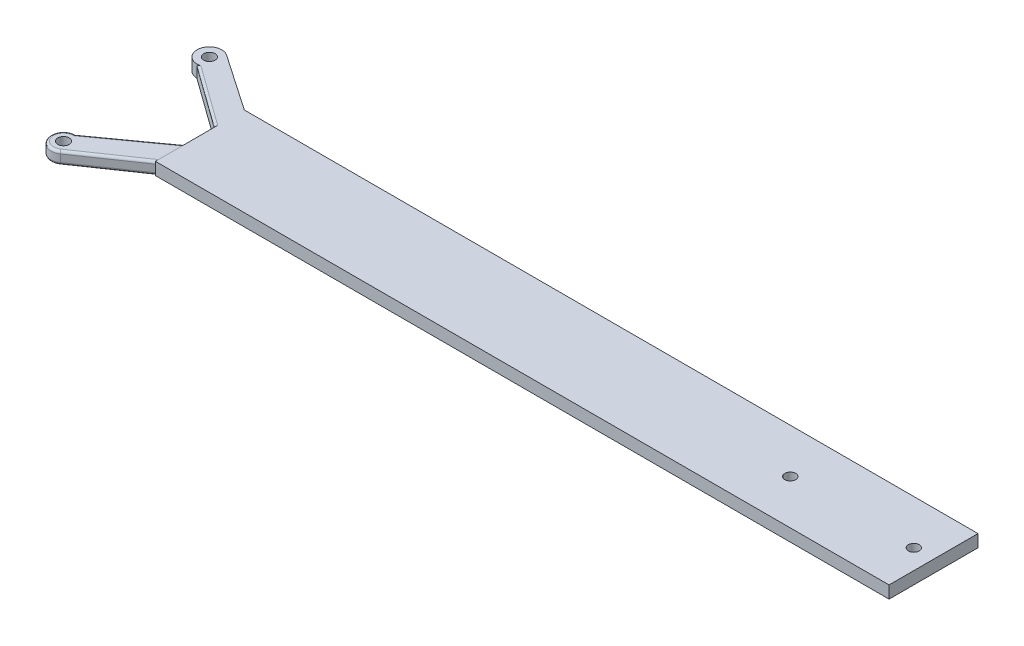
ISO-10303-21;
HEADER;
FILE_DESCRIPTION(('STEP AP214'),'2;1');
FILE_NAME('part.step','',(''),(''),'','','');
FILE_SCHEMA(('AUTOMOTIVE_DESIGN { 1 0 10303 214 1 1 1 1 }'));
ENDSEC;
DATA;
#1=APPLICATION_CONTEXT('core data for automotive mechanical design processes');
#2=APPLICATION_PROTOCOL_DEFINITION('international standard','automotive_design',2000,#1);
#3=PRODUCT_CONTEXT('',#1,'mechanical');
#4=PRODUCT('Part','Part','',(#3));
#5=PRODUCT_RELATED_PRODUCT_CATEGORY('part','',(#4));
#6=PRODUCT_DEFINITION_FORMATION('','',#4);
#7=PRODUCT_DEFINITION_CONTEXT('part definition',#1,'design');
#8=PRODUCT_DEFINITION('design','',#6,#7);
#9=PRODUCT_DEFINITION_SHAPE('','',#8);
#10=(LENGTH_UNIT() NAMED_UNIT(*) SI_UNIT(.MILLI.,.METRE.));
#11=(NAMED_UNIT(*) PLANE_ANGLE_UNIT() SI_UNIT($,.RADIAN.));
#12=(NAMED_UNIT(*) SI_UNIT($,.STERADIAN.) SOLID_ANGLE_UNIT());
#13=UNCERTAINTY_MEASURE_WITH_UNIT(LENGTH_MEASURE(1.E-05),#10,'distance_accuracy_value','');
#14=(GEOMETRIC_REPRESENTATION_CONTEXT(3) GLOBAL_UNCERTAINTY_ASSIGNED_CONTEXT((#13)) GLOBAL_UNIT_ASSIGNED_CONTEXT((#10,
#11,#12)) REPRESENTATION_CONTEXT('',''));
#15=CARTESIAN_POINT('',(0.,0.,0.));
#16=DIRECTION('',(0.,0.,1.));
#17=DIRECTION('',(1.,0.,0.));
#18=AXIS2_PLACEMENT_3D('',#15,#16,#17);
#19=CARTESIAN_POINT('',(-73.9332584912231,-0.60108083999999,102.697933506794));
#20=DIRECTION('',(0.58425656444107,0.,-0.811569015492532));
#21=DIRECTION('',(-0.811569015492532,0.,-0.58425656444107));
#22=AXIS2_PLACEMENT_3D('',#19,#20,#21);
#23=PLANE('',#22);
#24=DIRECTION('',(0.,-1.,0.));
#25=VECTOR('',#24,1.);
#26=CARTESIAN_POINT('',(-159.44986344,-0.601080839999992,41.1336834476488));
#27=LINE('',#26,#25);
#28=CARTESIAN_POINT('',(-159.44986344,-1.10108083999999,41.1336834476488));
#29=VERTEX_POINT('',#28);
#30=CARTESIAN_POINT('',(-159.44986344,-3.10108083999999,41.1336834476488));
#31=VERTEX_POINT('',#30);
#32=EDGE_CURVE('E233',#29,#31,#27,.T.);
#33=ORIENTED_EDGE('',*,*,#32,.F.);
#34=DIRECTION('',(0.811569015492532,0.,0.58425656444107));
#35=VECTOR('',#34,1.);
#36=CARTESIAN_POINT('',(-73.9332584912231,-1.10108083999999,102.697933506794));
#37=LINE('',#36,#35);
#38=CARTESIAN_POINT('',(-172.326559484456,-1.10108083999999,31.8636225548977));
#39=VERTEX_POINT('',#38);
#40=EDGE_CURVE('E68',#29,#39,#37,.F.);
#41=ORIENTED_EDGE('',*,*,#40,.T.);
#42=DIRECTION('',(0.,-1.,0.));
#43=VECTOR('',#42,1.);
#44=CARTESIAN_POINT('',(-172.326559484456,-0.601080839999992,31.8636225548977));
#45=LINE('',#44,#43);
#46=CARTESIAN_POINT('',(-172.326559484456,-3.10108083999999,31.8636225548977));
#47=VERTEX_POINT('',#46);
#48=EDGE_CURVE('E222',#39,#47,#45,.T.);
#49=ORIENTED_EDGE('',*,*,#48,.T.);
#50=DIRECTION('',(0.811569015492532,0.,0.58425656444107));
#51=VECTOR('',#50,1.);
#52=CARTESIAN_POINT('',(-73.9332584912231,-3.10108083999999,102.697933506794));
#53=LINE('',#52,#51);
#54=EDGE_CURVE('E212',#47,#31,#53,.T.);
#55=ORIENTED_EDGE('',*,*,#54,.T.);
#56=EDGE_LOOP('',(#33,#41,#49,#55));
#57=FACE_BOUND('',#56,.T.);
#58=ADVANCED_FACE('F47',(#57),#23,.F.);
#59=CARTESIAN_POINT('',(-67.3996265871975,-0.601080839999992,98.2684248513683));
#60=DIRECTION('',(0.565617191343844,0.,-0.824667928839421));
#61=DIRECTION('',(-0.824667928839421,0.,-0.565617191343844));
#62=AXIS2_PLACEMENT_3D('',#59,#60,#61);
#63=PLANE('',#62);
#64=DIRECTION('',(0.824667928839421,0.,0.565617191343844));
#65=VECTOR('',#64,1.);
#66=CARTESIAN_POINT('',(-67.3996265871975,-3.10108083999999,98.2684248513683));
#67=LINE('',#66,#65);
#68=CARTESIAN_POINT('',(-170.868743398249,-3.10108083999999,27.3017858020511));
#69=VERTEX_POINT('',#68);
#70=CARTESIAN_POINT('',(-159.44986344,-3.10108083999999,35.1336834476488));
#71=VERTEX_POINT('',#70);
#72=EDGE_CURVE('E228',#69,#71,#67,.T.);
#73=ORIENTED_EDGE('',*,*,#72,.F.);
#74=DIRECTION('',(0.,-1.,0.));
#75=VECTOR('',#74,1.);
#76=CARTESIAN_POINT('',(-170.868743398249,-0.601080839999994,27.3017858020511));
#77=LINE('',#76,#75);
#78=CARTESIAN_POINT('',(-170.868743398249,-0.601080839999994,27.3017858020511));
#79=VERTEX_POINT('',#78);
#80=EDGE_CURVE('E238',#79,#69,#77,.T.);
#81=ORIENTED_EDGE('',*,*,#80,.F.);
#82=DIRECTION('',(0.824667928839421,0.,0.565617191343844));
#83=VECTOR('',#82,1.);
#84=CARTESIAN_POINT('',(-67.3996265871975,-0.601080839999992,98.2684248513683));
#85=LINE('',#84,#83);
#86=CARTESIAN_POINT('',(-159.44986344,-0.601080839999994,35.1336834476488));
#87=VERTEX_POINT('',#86);
#88=EDGE_CURVE('E216',#79,#87,#85,.T.);
#89=ORIENTED_EDGE('',*,*,#88,.T.);
#90=DIRECTION('',(0.,-1.,0.));
#91=VECTOR('',#90,1.);
#92=CARTESIAN_POINT('',(-159.44986344,-0.601080839999994,35.1336834476488));
#93=LINE('',#92,#91);
#94=EDGE_CURVE('E236',#87,#71,#93,.T.);
#95=ORIENTED_EDGE('',*,*,#94,.T.);
#96=EDGE_LOOP('',(#73,#81,#89,#95));
#97=FACE_BOUND('',#96,.T.);
#98=ADVANCED_FACE('F292',(#97),#63,.T.);
#99=CARTESIAN_POINT('',(-172.282955989426,-0.601080839999993,29.3637029190566));
#100=DIRECTION('',(0.,-1.,0.));
#101=DIRECTION('',(0.,0.,-1.));
#102=AXIS2_PLACEMENT_3D('',#99,#100,#101);
#103=CYLINDRICAL_SURFACE('',#102,2.5002998721039);
#104=CARTESIAN_POINT('',(-172.282955989426,-3.10108083999999,29.3637029190566));
#105=DIRECTION('',(0.,-1.,0.));
#106=DIRECTION('',(0.,0.,-1.));
#107=AXIS2_PLACEMENT_3D('',#104,#105,#106);
#108=CIRCLE('',#107,2.5002998721039);
#109=EDGE_CURVE('E225',#47,#69,#108,.T.);
#110=ORIENTED_EDGE('',*,*,#109,.F.);
#111=ORIENTED_EDGE('',*,*,#48,.F.);
#112=CARTESIAN_POINT('',(-172.326559484456,-1.10108083999999,31.8636225548977));
#113=CARTESIAN_POINT('',(-172.326604406774,-1.08375546396516,31.8636169754297));
#114=CARTESIAN_POINT('',(-172.324981931734,-1.06648942092344,31.8636502819655));
#115=CARTESIAN_POINT('',(-172.318820860716,-1.0326755288501,31.8637486250927));
#116=CARTESIAN_POINT('',(-172.314314898324,-1.0161218278788,31.8638133046647));
#117=CARTESIAN_POINT('',(-172.301311245044,-0.979800529380049,31.8639452335376));
#118=CARTESIAN_POINT('',(-172.292086192981,-0.960297484864032,31.8640088876483));
#119=CARTESIAN_POINT('',(-172.270614896063,-0.922966349821644,31.86399566491));
#120=CARTESIAN_POINT('',(-172.258354207195,-0.905146846812921,31.8639181045926));
#121=CARTESIAN_POINT('',(-172.224528932993,-0.86225090256567,31.8634028393248));
#122=CARTESIAN_POINT('',(-172.201483311581,-0.838352633878603,31.8627955952886));
#123=CARTESIAN_POINT('',(-172.152131940226,-0.794280017422026,31.8607015081635));
#124=CARTESIAN_POINT('',(-172.125819032106,-0.774114096109017,31.8592127058401));
#125=CARTESIAN_POINT('',(-172.058209825312,-0.728523805578944,31.8542057397185));
#126=CARTESIAN_POINT('',(-172.015650438529,-0.705035475237499,31.8500648492516));
#127=CARTESIAN_POINT('',(-171.927820892891,-0.664901916022186,31.8390509195129));
#128=CARTESIAN_POINT('',(-171.882551534465,-0.648254677849192,31.8321786836336));
#129=CARTESIAN_POINT('',(-171.797926400579,-0.624151973087368,31.8168187800189));
#130=CARTESIAN_POINT('',(-171.758790817439,-0.615648652632069,31.8087688245611));
#131=CARTESIAN_POINT('',(-171.680255352497,-0.604134429348084,31.7906151718924));
#132=CARTESIAN_POINT('',(-171.640855887737,-0.601116291690356,31.7805141995155));
#133=CARTESIAN_POINT('',(-171.601663290387,-0.601080839999993,31.7693919489768));
#134=B_SPLINE_CURVE_WITH_KNOTS('',3,(#112,#113,#114,#115,#116,#117,#118,#119,#120,#121,#122,
#123,#124,#125,#126,#127,#128,#129,#130,#131,#132,#133),.UNSPECIFIED.,.F.,.F.,(4,2,2,2,2,2,2,2,
2,2,4),(0.,0.0518043711022378,0.103032577684879,0.167398996760702,0.232077773564686,
0.331140867240822,0.430424956161014,0.576029112518887,0.721590472820486,0.843735754287807,
0.965719811710755),.UNSPECIFIED.);
#135=CARTESIAN_POINT('',(-171.601663290387,-0.601080839999993,31.7693919489768));
#136=VERTEX_POINT('',#135);
#137=EDGE_CURVE('E12',#39,#136,#134,.T.);
#138=ORIENTED_EDGE('',*,*,#137,.T.);
#139=CARTESIAN_POINT('',(-172.282955989426,-0.601080839999993,29.3637029190566));
#140=DIRECTION('',(0.,-1.,0.));
#141=DIRECTION('',(0.,0.,-1.));
#142=AXIS2_PLACEMENT_3D('',#139,#140,#141);
#143=CIRCLE('',#142,2.5002998721039);
#144=EDGE_CURVE('E213',#136,#79,#143,.T.);
#145=ORIENTED_EDGE('',*,*,#144,.T.);
#146=ORIENTED_EDGE('',*,*,#80,.T.);
#147=EDGE_LOOP('',(#110,#111,#138,#145,#146));
#148=FACE_BOUND('',#147,.T.);
#149=ADVANCED_FACE('F267',(#148),#103,.T.);
#150=CARTESIAN_POINT('',(-172.282955989426,-0.601080839999993,29.3637029190566));
#151=DIRECTION('',(0.,-1.,0.));
#152=DIRECTION('',(0.,0.,-1.));
#153=AXIS2_PLACEMENT_3D('',#150,#151,#152);
#154=CYLINDRICAL_SURFACE('',#153,1.15000024000001);
#155=CARTESIAN_POINT('',(-172.282955989426,-0.601080839999993,29.3637029190566));
#156=DIRECTION('',(0.,-1.,0.));
#157=DIRECTION('',(0.,0.,-1.));
#158=AXIS2_PLACEMENT_3D('',#155,#156,#157);
#159=CIRCLE('',#158,1.15000024000001);
#160=CARTESIAN_POINT('',(-172.282955989426,-0.601080839999993,28.2137026790566));
#161=VERTEX_POINT('',#160);
#162=EDGE_CURVE('E219',#161,#161,#159,.T.);
#163=ORIENTED_EDGE('',*,*,#162,.F.);
#164=EDGE_LOOP('',(#163));
#165=FACE_BOUND('',#164,.T.);
#166=CARTESIAN_POINT('',(-172.282955989426,-3.10108083999999,29.3637029190566));
#167=DIRECTION('',(0.,-1.,0.));
#168=DIRECTION('',(0.,0.,-1.));
#169=AXIS2_PLACEMENT_3D('',#166,#167,#168);
#170=CIRCLE('',#169,1.15000024000001);
#171=CARTESIAN_POINT('',(-172.282955989426,-3.10108083999999,28.2137026790566));
#172=VERTEX_POINT('',#171);
#173=EDGE_CURVE('E217',#172,#172,#170,.T.);
#174=ORIENTED_EDGE('',*,*,#173,.T.);
#175=EDGE_LOOP('',(#174));
#176=FACE_BOUND('',#175,.T.);
#177=ADVANCED_FACE('F299',(#165,#176),#154,.F.);
#178=CARTESIAN_POINT('',(0.,-0.60108084000003,0.));
#179=DIRECTION('',(0.,-1.,0.));
#180=DIRECTION('',(0.,0.,-1.));
#181=AXIS2_PLACEMENT_3D('',#178,#179,#180);
#182=PLANE('',#181);
#183=DIRECTION('',(0.811569015492532,0.,0.58425656444107));
#184=VECTOR('',#183,1.);
#185=CARTESIAN_POINT('',(-73.6411302090026,-0.60108083999999,102.292148999048));
#186=LINE('',#185,#184);
#187=CARTESIAN_POINT('',(-159.44986344,-0.601080839999992,40.5175928990261));
#188=VERTEX_POINT('',#187);
#189=EDGE_CURVE('E250',#136,#188,#186,.T.);
#190=ORIENTED_EDGE('',*,*,#189,.T.);
#191=DIRECTION('',(0.,0.,-1.));
#192=VECTOR('',#191,1.);
#193=CARTESIAN_POINT('',(-159.44986344,-0.601080839999989,53.1336834476488));
#194=LINE('',#193,#192);
#195=CARTESIAN_POINT('',(-159.44986344,-0.601080839999989,53.1336834476488));
#196=VERTEX_POINT('',#195);
#197=EDGE_CURVE('E199',#196,#188,#194,.T.);
#198=ORIENTED_EDGE('',*,*,#197,.F.);
#199=DIRECTION('',(-1.,0.,0.));
#200=VECTOR('',#199,1.);
#201=CARTESIAN_POINT('',(-10.94976104,-0.601080840000014,53.1336834476488));
#202=LINE('',#201,#200);
#203=CARTESIAN_POINT('',(-10.94976104,-0.601080840000014,53.1336834476488));
#204=VERTEX_POINT('',#203);
#205=EDGE_CURVE('E183',#204,#196,#202,.T.);
#206=ORIENTED_EDGE('',*,*,#205,.F.);
#207=DIRECTION('',(0.,0.,1.));
#208=VECTOR('',#207,1.);
#209=CARTESIAN_POINT('',(-10.94976104,-0.601080840000019,35.1336834476488));
#210=LINE('',#209,#208);
#211=CARTESIAN_POINT('',(-10.94976104,-0.601080840000019,35.1336834476488));
#212=VERTEX_POINT('',#211);
#213=EDGE_CURVE('E190',#212,#204,#210,.T.);
#214=ORIENTED_EDGE('',*,*,#213,.F.);
#215=DIRECTION('',(1.,0.,0.));
#216=VECTOR('',#215,1.);
#217=CARTESIAN_POINT('',(-10.94976104,-0.601080840000019,35.1336834476488));
#218=LINE('',#217,#216);
#219=EDGE_CURVE('E201',#87,#212,#218,.T.);
#220=ORIENTED_EDGE('',*,*,#219,.F.);
#221=ORIENTED_EDGE('',*,*,#88,.F.);
#222=ORIENTED_EDGE('',*,*,#144,.F.);
#223=EDGE_LOOP('',(#190,#198,#206,#214,#220,#221,#222));
#224=FACE_BOUND('',#223,.T.);
#225=ORIENTED_EDGE('',*,*,#162,.T.);
#226=EDGE_LOOP('',(#225));
#227=FACE_BOUND('',#226,.T.);
#228=CARTESIAN_POINT('',(-14.94976104,-0.601080840000015,44.1336834476488));
#229=DIRECTION('',(0.,-1.,0.));
#230=DIRECTION('',(0.,0.,-1.));
#231=AXIS2_PLACEMENT_3D('',#228,#229,#230);
#232=CIRCLE('',#231,1.10000033999999);
#233=CARTESIAN_POINT('',(-14.94976104,-0.601080840000016,43.0336831076488));
#234=VERTEX_POINT('',#233);
#235=EDGE_CURVE('E177',#234,#234,#232,.T.);
#236=ORIENTED_EDGE('',*,*,#235,.T.);
#237=EDGE_LOOP('',(#236));
#238=FACE_BOUND('',#237,.T.);
#239=CARTESIAN_POINT('',(-39.94986344,-0.601080840000011,44.1336834476488));
#240=DIRECTION('',(0.,-1.,0.));
#241=DIRECTION('',(0.,0.,-1.));
#242=AXIS2_PLACEMENT_3D('',#239,#240,#241);
#243=CIRCLE('',#242,1.10000033999999);
#244=CARTESIAN_POINT('',(-39.94986344,-0.601080840000012,43.0336831076488));
#245=VERTEX_POINT('',#244);
#246=EDGE_CURVE('E170',#245,#245,#243,.T.);
#247=ORIENTED_EDGE('',*,*,#246,.T.);
#248=EDGE_LOOP('',(#247));
#249=FACE_BOUND('',#248,.T.);
#250=ADVANCED_FACE('F259',(#224,#227,#238,#249),#182,.F.);
#251=CARTESIAN_POINT('',(0.,-3.10108084000003,0.));
#252=DIRECTION('',(0.,-1.,0.));
#253=DIRECTION('',(0.,0.,-1.));
#254=AXIS2_PLACEMENT_3D('',#251,#252,#253);
#255=PLANE('',#254);
#256=DIRECTION('',(0.,0.,-1.));
#257=VECTOR('',#256,1.);
#258=CARTESIAN_POINT('',(-159.44986344,-3.10108083999999,47.1336834476488));
#259=LINE('',#258,#257);
#260=CARTESIAN_POINT('',(-159.44986344,-3.10108083999999,40.8642380029717));
#261=VERTEX_POINT('',#260);
#262=EDGE_CURVE('E235',#31,#261,#259,.T.);
#263=ORIENTED_EDGE('',*,*,#262,.F.);
#264=ORIENTED_EDGE('',*,*,#54,.F.);
#265=ORIENTED_EDGE('',*,*,#109,.T.);
#266=ORIENTED_EDGE('',*,*,#72,.T.);
#267=DIRECTION('',(1.,0.,0.));
#268=VECTOR('',#267,1.);
#269=CARTESIAN_POINT('',(-10.94976104,-3.10108084000002,35.1336834476488));
#270=LINE('',#269,#268);
#271=CARTESIAN_POINT('',(-10.94976104,-3.10108084000002,35.1336834476488));
#272=VERTEX_POINT('',#271);
#273=EDGE_CURVE('E192',#71,#272,#270,.T.);
#274=ORIENTED_EDGE('',*,*,#273,.T.);
#275=DIRECTION('',(0.,0.,1.));
#276=VECTOR('',#275,1.);
#277=CARTESIAN_POINT('',(-10.94976104,-3.10108084000002,35.1336834476488));
#278=LINE('',#277,#276);
#279=CARTESIAN_POINT('',(-10.94976104,-3.10108084000001,53.1336834476488));
#280=VERTEX_POINT('',#279);
#281=EDGE_CURVE('E194',#272,#280,#278,.T.);
#282=ORIENTED_EDGE('',*,*,#281,.T.);
#283=DIRECTION('',(-1.,0.,0.));
#284=VECTOR('',#283,1.);
#285=CARTESIAN_POINT('',(-10.94976104,-3.10108084000001,53.1336834476488));
#286=LINE('',#285,#284);
#287=CARTESIAN_POINT('',(-159.44986344,-3.10108083999999,53.1336834476488));
#288=VERTEX_POINT('',#287);
#289=EDGE_CURVE('E186',#280,#288,#286,.T.);
#290=ORIENTED_EDGE('',*,*,#289,.T.);
#291=DIRECTION('',(0.,0.,-1.));
#292=VECTOR('',#291,1.);
#293=CARTESIAN_POINT('',(-159.44986344,-3.10108083999999,53.1336834476488));
#294=LINE('',#293,#292);
#295=CARTESIAN_POINT('',(-159.44986344,-3.10108083999999,47.1336834476488));
#296=VERTEX_POINT('',#295);
#297=EDGE_CURVE('E189',#288,#296,#294,.T.);
#298=ORIENTED_EDGE('',*,*,#297,.T.);
#299=DIRECTION('',(-1.,0.,0.));
#300=VECTOR('',#299,1.);
#301=CARTESIAN_POINT('',(-159.44986344,-3.10108083999999,47.1336834476488));
#302=LINE('',#301,#300);
#303=CARTESIAN_POINT('',(-44.9493571194185,-3.10108084000001,47.1336834476488));
#304=VERTEX_POINT('',#303);
#305=EDGE_CURVE('E168',#304,#296,#302,.T.);
#306=ORIENTED_EDGE('',*,*,#305,.F.);
#307=DIRECTION('',(0.,0.,1.));
#308=VECTOR('',#307,1.);
#309=CARTESIAN_POINT('',(-44.9493571194185,-3.10108084000001,47.1336834476488));
#310=LINE('',#309,#308);
#311=CARTESIAN_POINT('',(-44.9493571194185,-3.10108084000001,40.8642380029717));
#312=VERTEX_POINT('',#311);
#313=EDGE_CURVE('E146',#312,#304,#310,.T.);
#314=ORIENTED_EDGE('',*,*,#313,.F.);
#315=DIRECTION('',(1.,0.,0.));
#316=VECTOR('',#315,1.);
#317=CARTESIAN_POINT('',(-159.44986344,-3.10108083999999,40.8642380029717));
#318=LINE('',#317,#316);
#319=EDGE_CURVE('E156',#261,#312,#318,.T.);
#320=ORIENTED_EDGE('',*,*,#319,.F.);
#321=EDGE_LOOP('',(#263,#264,#265,#266,#274,#282,#290,#298,#306,#314,#320));
#322=FACE_BOUND('',#321,.T.);
#323=ORIENTED_EDGE('',*,*,#173,.F.);
#324=EDGE_LOOP('',(#323));
#325=FACE_BOUND('',#324,.T.);
#326=CARTESIAN_POINT('',(-14.94976104,-3.10108084000002,44.1336834476488));
#327=DIRECTION('',(0.,-1.,0.));
#328=DIRECTION('',(0.,0.,-1.));
#329=AXIS2_PLACEMENT_3D('',#326,#327,#328);
#330=CIRCLE('',#329,1.10000033999999);
#331=CARTESIAN_POINT('',(-14.94976104,-3.10108084000002,43.0336831076488));
#332=VERTEX_POINT('',#331);
#333=EDGE_CURVE('E180',#332,#332,#330,.T.);
#334=ORIENTED_EDGE('',*,*,#333,.F.);
#335=EDGE_LOOP('',(#334));
#336=FACE_BOUND('',#335,.T.);
#337=CARTESIAN_POINT('',(-39.94986344,-3.10108084000001,44.1336834476488));
#338=DIRECTION('',(0.,-1.,0.));
#339=DIRECTION('',(0.,0.,-1.));
#340=AXIS2_PLACEMENT_3D('',#337,#338,#339);
#341=CIRCLE('',#340,1.10000033999999);
#342=CARTESIAN_POINT('',(-39.94986344,-3.10108084000001,43.0336831076488));
#343=VERTEX_POINT('',#342);
#344=EDGE_CURVE('E174',#343,#343,#341,.T.);
#345=ORIENTED_EDGE('',*,*,#344,.F.);
#346=EDGE_LOOP('',(#345));
#347=FACE_BOUND('',#346,.T.);
#348=ADVANCED_FACE('F164',(#322,#325,#336,#347),#255,.T.);
#349=CARTESIAN_POINT('',(-159.44986344,-3.10108083999999,53.1336834476488));
#350=DIRECTION('',(1.,0.,0.));
#351=DIRECTION('',(0.,1.,0.));
#352=AXIS2_PLACEMENT_3D('',#349,#350,#351);
#353=PLANE('',#352);
#354=ORIENTED_EDGE('',*,*,#197,.T.);
#355=CARTESIAN_POINT('',(-159.44986344,-1.10108083999999,40.5175928990261));
#356=DIRECTION('',(1.,0.,0.));
#357=DIRECTION('',(0.,0.,1.));
#358=AXIS2_PLACEMENT_3D('',#355,#356,#357);
#359=ELLIPSE('',#358,0.616090548622726,0.5);
#360=EDGE_CURVE('E61',#188,#29,#359,.T.);
#361=ORIENTED_EDGE('',*,*,#360,.T.);
#362=ORIENTED_EDGE('',*,*,#32,.T.);
#363=DIRECTION('',(0.,0.,-1.));
#364=VECTOR('',#363,1.);
#365=CARTESIAN_POINT('',(-159.44986344,-3.10108083999999,47.1336834476488));
#366=LINE('',#365,#364);
#367=EDGE_CURVE('E248',#31,#296,#366,.F.);
#368=ORIENTED_EDGE('',*,*,#367,.T.);
#369=ORIENTED_EDGE('',*,*,#297,.F.);
#370=DIRECTION('',(0.,1.,0.));
#371=VECTOR('',#370,1.);
#372=CARTESIAN_POINT('',(-159.44986344,-3.10108083999999,53.1336834476488));
#373=LINE('',#372,#371);
#374=EDGE_CURVE('E209',#288,#196,#373,.T.);
#375=ORIENTED_EDGE('',*,*,#374,.T.);
#376=EDGE_LOOP('',(#354,#361,#362,#368,#369,#375));
#377=FACE_BOUND('',#376,.T.);
#378=ADVANCED_FACE('F274',(#377),#353,.F.);
#379=CARTESIAN_POINT('',(-10.94976104,-3.10108084000001,53.1336834476488));
#380=DIRECTION('',(0.,0.,-1.));
#381=DIRECTION('',(0.,1.,0.));
#382=AXIS2_PLACEMENT_3D('',#379,#380,#381);
#383=PLANE('',#382);
#384=ORIENTED_EDGE('',*,*,#205,.T.);
#385=ORIENTED_EDGE('',*,*,#374,.F.);
#386=ORIENTED_EDGE('',*,*,#289,.F.);
#387=DIRECTION('',(0.,1.,0.));
#388=VECTOR('',#387,1.);
#389=CARTESIAN_POINT('',(-10.94976104,-3.10108084000001,53.1336834476488));
#390=LINE('',#389,#388);
#391=EDGE_CURVE('E196',#280,#204,#390,.T.);
#392=ORIENTED_EDGE('',*,*,#391,.T.);
#393=EDGE_LOOP('',(#384,#385,#386,#392));
#394=FACE_BOUND('',#393,.T.);
#395=ADVANCED_FACE('F280',(#394),#383,.F.);
#396=CARTESIAN_POINT('',(-10.94976104,-3.10108084000002,35.1336834476488));
#397=DIRECTION('',(0.,0.,1.));
#398=DIRECTION('',(0.,-1.,0.));
#399=AXIS2_PLACEMENT_3D('',#396,#397,#398);
#400=PLANE('',#399);
#401=ORIENTED_EDGE('',*,*,#219,.T.);
#402=DIRECTION('',(0.,1.,0.));
#403=VECTOR('',#402,1.);
#404=CARTESIAN_POINT('',(-10.94976104,-3.10108084000002,35.1336834476488));
#405=LINE('',#404,#403);
#406=EDGE_CURVE('E206',#272,#212,#405,.T.);
#407=ORIENTED_EDGE('',*,*,#406,.F.);
#408=ORIENTED_EDGE('',*,*,#273,.F.);
#409=ORIENTED_EDGE('',*,*,#94,.F.);
#410=EDGE_LOOP('',(#401,#407,#408,#409));
#411=FACE_BOUND('',#410,.T.);
#412=ADVANCED_FACE('F288',(#411),#400,.F.);
#413=CARTESIAN_POINT('',(-10.94976104,-3.10108084000002,35.1336834476488));
#414=DIRECTION('',(-1.,0.,0.));
#415=DIRECTION('',(0.,-1.,0.));
#416=AXIS2_PLACEMENT_3D('',#413,#414,#415);
#417=PLANE('',#416);
#418=ORIENTED_EDGE('',*,*,#213,.T.);
#419=ORIENTED_EDGE('',*,*,#391,.F.);
#420=ORIENTED_EDGE('',*,*,#281,.F.);
#421=ORIENTED_EDGE('',*,*,#406,.T.);
#422=EDGE_LOOP('',(#418,#419,#420,#421));
#423=FACE_BOUND('',#422,.T.);
#424=ADVANCED_FACE('F284',(#423),#417,.F.);
#425=CARTESIAN_POINT('',(-14.94976104,-3.10108084000002,44.1336834476488));
#426=DIRECTION('',(0.,1.,0.));
#427=DIRECTION('',(0.,0.,1.));
#428=AXIS2_PLACEMENT_3D('',#425,#426,#427);
#429=CYLINDRICAL_SURFACE('',#428,1.10000033999999);
#430=ORIENTED_EDGE('',*,*,#333,.T.);
#431=EDGE_LOOP('',(#430));
#432=FACE_BOUND('',#431,.T.);
#433=ORIENTED_EDGE('',*,*,#235,.F.);
#434=EDGE_LOOP('',(#433));
#435=FACE_BOUND('',#434,.T.);
#436=ADVANCED_FACE('F323',(#432,#435),#429,.F.);
#437=CARTESIAN_POINT('',(-39.94986344,-3.10108084000001,44.1336834476488));
#438=DIRECTION('',(0.,1.,0.));
#439=DIRECTION('',(0.,0.,1.));
#440=AXIS2_PLACEMENT_3D('',#437,#438,#439);
#441=CYLINDRICAL_SURFACE('',#440,1.10000033999999);
#442=ORIENTED_EDGE('',*,*,#344,.T.);
#443=EDGE_LOOP('',(#442));
#444=FACE_BOUND('',#443,.T.);
#445=ORIENTED_EDGE('',*,*,#246,.F.);
#446=EDGE_LOOP('',(#445));
#447=FACE_BOUND('',#446,.T.);
#448=ADVANCED_FACE('F317',(#444,#447),#441,.F.);
#449=CARTESIAN_POINT('',(0.,-4.10108084000003,0.));
#450=DIRECTION('',(0.,-1.,0.));
#451=DIRECTION('',(0.,0.,-1.));
#452=AXIS2_PLACEMENT_3D('',#449,#450,#451);
#453=PLANE('',#452);
#454=DIRECTION('',(0.,0.,1.));
#455=VECTOR('',#454,1.);
#456=CARTESIAN_POINT('',(-45.9493571194185,-4.10108084000001,47.1336834476488));
#457=LINE('',#456,#455);
#458=CARTESIAN_POINT('',(-45.9493571194185,-4.10108084000001,41.8642380029717));
#459=VERTEX_POINT('',#458);
#460=CARTESIAN_POINT('',(-45.9493571194185,-4.10108084000001,46.1336834476488));
#461=VERTEX_POINT('',#460);
#462=EDGE_CURVE('E149',#459,#461,#457,.T.);
#463=ORIENTED_EDGE('',*,*,#462,.T.);
#464=DIRECTION('',(-1.,0.,0.));
#465=VECTOR('',#464,1.);
#466=CARTESIAN_POINT('',(-159.44986344,-4.10108083999999,46.1336834476488));
#467=LINE('',#466,#465);
#468=CARTESIAN_POINT('',(-158.44986344,-4.10108083999999,46.1336834476488));
#469=VERTEX_POINT('',#468);
#470=EDGE_CURVE('E246',#461,#469,#467,.T.);
#471=ORIENTED_EDGE('',*,*,#470,.T.);
#472=DIRECTION('',(0.,0.,-1.));
#473=VECTOR('',#472,1.);
#474=CARTESIAN_POINT('',(-158.44986344,-4.10108083999999,40.8642380029717));
#475=LINE('',#474,#473);
#476=CARTESIAN_POINT('',(-158.44986344,-4.10108083999999,41.8642380029717));
#477=VERTEX_POINT('',#476);
#478=EDGE_CURVE('E243',#469,#477,#475,.T.);
#479=ORIENTED_EDGE('',*,*,#478,.T.);
#480=DIRECTION('',(1.,0.,0.));
#481=VECTOR('',#480,1.);
#482=CARTESIAN_POINT('',(-44.9493571194185,-4.10108084000001,41.8642380029717));
#483=LINE('',#482,#481);
#484=EDGE_CURVE('E241',#477,#459,#483,.T.);
#485=ORIENTED_EDGE('',*,*,#484,.T.);
#486=EDGE_LOOP('',(#463,#471,#479,#485));
#487=FACE_BOUND('',#486,.T.);
#488=ADVANCED_FACE('F313',(#487),#453,.T.);
#489=CARTESIAN_POINT('',(-158.44986344,-3.10108084,0.));
#490=DIRECTION('',(0.,0.,1.));
#491=DIRECTION('',(0.,-1.,0.));
#492=AXIS2_PLACEMENT_3D('',#489,#490,#491);
#493=CYLINDRICAL_SURFACE('',#492,1.);
#494=ORIENTED_EDGE('',*,*,#367,.F.);
#495=ORIENTED_EDGE('',*,*,#262,.T.);
#496=CARTESIAN_POINT('',(-158.44986344,-3.10108083999999,41.8642380029717));
#497=DIRECTION('',(-0.707106781186547,0.,0.707106781186547));
#498=DIRECTION('',(-0.707106781186547,0.,-0.707106781186547));
#499=AXIS2_PLACEMENT_3D('',#496,#497,#498);
#500=ELLIPSE('',#499,1.41421356237309,1.);
#501=EDGE_CURVE('E159',#477,#261,#500,.F.);
#502=ORIENTED_EDGE('',*,*,#501,.F.);
#503=ORIENTED_EDGE('',*,*,#478,.F.);
#504=CARTESIAN_POINT('',(-158.44986344,-3.10108083999999,46.1336834476488));
#505=DIRECTION('',(0.707106781186547,0.,0.707106781186547));
#506=DIRECTION('',(0.707106781186547,0.,-0.707106781186547));
#507=AXIS2_PLACEMENT_3D('',#504,#505,#506);
#508=ELLIPSE('',#507,1.41421356237309,1.);
#509=EDGE_CURVE('E152',#296,#469,#508,.T.);
#510=ORIENTED_EDGE('',*,*,#509,.F.);
#511=EDGE_LOOP('',(#494,#495,#502,#503,#510));
#512=FACE_BOUND('',#511,.T.);
#513=ADVANCED_FACE('F271',(#512),#493,.T.);
#514=CARTESIAN_POINT('',(0.,-3.10108084000002,41.8642380029717));
#515=DIRECTION('',(-1.,0.,0.));
#516=DIRECTION('',(0.,-1.,0.));
#517=AXIS2_PLACEMENT_3D('',#514,#515,#516);
#518=CYLINDRICAL_SURFACE('',#517,1.);
#519=ORIENTED_EDGE('',*,*,#501,.T.);
#520=ORIENTED_EDGE('',*,*,#319,.T.);
#521=CARTESIAN_POINT('',(-45.9493571194185,-3.10108084000001,41.8642380029717));
#522=DIRECTION('',(-0.707106781186547,0.,-0.707106781186547));
#523=DIRECTION('',(-0.707106781186547,0.,0.707106781186547));
#524=AXIS2_PLACEMENT_3D('',#521,#522,#523);
#525=ELLIPSE('',#524,1.41421356237309,1.);
#526=EDGE_CURVE('E142',#459,#312,#525,.F.);
#527=ORIENTED_EDGE('',*,*,#526,.F.);
#528=ORIENTED_EDGE('',*,*,#484,.F.);
#529=EDGE_LOOP('',(#519,#520,#527,#528));
#530=FACE_BOUND('',#529,.T.);
#531=ADVANCED_FACE('F157',(#530),#518,.T.);
#532=CARTESIAN_POINT('',(0.,-3.10108084000002,46.1336834476488));
#533=DIRECTION('',(1.,0.,0.));
#534=DIRECTION('',(0.,1.,0.));
#535=AXIS2_PLACEMENT_3D('',#532,#533,#534);
#536=CYLINDRICAL_SURFACE('',#535,1.);
#537=ORIENTED_EDGE('',*,*,#509,.T.);
#538=ORIENTED_EDGE('',*,*,#470,.F.);
#539=CARTESIAN_POINT('',(-45.9493571194185,-3.10108084000001,46.1336834476488));
#540=DIRECTION('',(0.707106781186547,0.,-0.707106781186547));
#541=DIRECTION('',(0.707106781186547,0.,0.707106781186547));
#542=AXIS2_PLACEMENT_3D('',#539,#540,#541);
#543=ELLIPSE('',#542,1.41421356237309,1.);
#544=EDGE_CURVE('E153',#304,#461,#543,.T.);
#545=ORIENTED_EDGE('',*,*,#544,.F.);
#546=ORIENTED_EDGE('',*,*,#305,.T.);
#547=EDGE_LOOP('',(#537,#538,#545,#546));
#548=FACE_BOUND('',#547,.T.);
#549=ADVANCED_FACE('F307',(#548),#536,.T.);
#550=CARTESIAN_POINT('',(-45.9493571194185,-3.10108084000002,0.));
#551=DIRECTION('',(0.,0.,-1.));
#552=DIRECTION('',(0.,1.,0.));
#553=AXIS2_PLACEMENT_3D('',#550,#551,#552);
#554=CYLINDRICAL_SURFACE('',#553,1.);
#555=ORIENTED_EDGE('',*,*,#526,.T.);
#556=ORIENTED_EDGE('',*,*,#313,.T.);
#557=ORIENTED_EDGE('',*,*,#544,.T.);
#558=ORIENTED_EDGE('',*,*,#462,.F.);
#559=EDGE_LOOP('',(#555,#556,#557,#558));
#560=FACE_BOUND('',#559,.T.);
#561=ADVANCED_FACE('F144',(#560),#554,.T.);
#562=CARTESIAN_POINT('',(-73.6411302090026,-1.10108083999999,102.292148999048));
#563=DIRECTION('',(0.811569015492532,0.,0.58425656444107));
#564=DIRECTION('',(0.58425656444107,0.,-0.811569015492532));
#565=AXIS2_PLACEMENT_3D('',#562,#563,#564);
#566=CYLINDRICAL_SURFACE('',#565,0.5);
#567=ORIENTED_EDGE('',*,*,#137,.F.);
#568=ORIENTED_EDGE('',*,*,#40,.F.);
#569=ORIENTED_EDGE('',*,*,#360,.F.);
#570=ORIENTED_EDGE('',*,*,#189,.F.);
#571=EDGE_LOOP('',(#567,#568,#569,#570));
#572=FACE_BOUND('',#571,.T.);
#573=ADVANCED_FACE('F49',(#572),#566,.T.);
#574=CLOSED_SHELL('',(#58,#98,#149,#177,#250,#348,#378,#395,#412,#424,#436,#448,#488,#513,#531,
#549,#561,#573));
#575=MANIFOLD_SOLID_BREP('B2',#574);
#576=CARTESIAN_POINT('',(-26.2243321231123,-0.601080840000036,-38.2370752851875));
#577=DIRECTION('',(-0.565596177382009,0.,-0.824682341347782));
#578=DIRECTION('',(-0.824682341347782,0.,0.565596177382009));
#579=AXIS2_PLACEMENT_3D('',#576,#577,#578);
#580=PLANE('',#579);
#581=DIRECTION('',(0.,-1.,0.));
#582=VECTOR('',#581,1.);
#583=CARTESIAN_POINT('',(-159.44986344,-0.601080839999989,53.1336834476488));
#584=LINE('',#583,#582);
#585=CARTESIAN_POINT('',(-159.44986344,-1.10108083999999,53.1336834476488));
#586=VERTEX_POINT('',#585);
#587=CARTESIAN_POINT('',(-159.44986344,-2.60108083999999,53.1336834476488));
#588=VERTEX_POINT('',#587);
#589=EDGE_CURVE('E544',#586,#588,#584,.T.);
#590=ORIENTED_EDGE('',*,*,#589,.F.);
#591=DIRECTION('',(0.824682341347782,0.,-0.565596177382009));
#592=VECTOR('',#591,1.);
#593=CARTESIAN_POINT('',(-26.2243321231123,-1.10108084000004,-38.2370752851875));
#594=LINE('',#593,#592);
#595=CARTESIAN_POINT('',(-170.868799939625,-1.10108083999999,60.9651920299722));
#596=VERTEX_POINT('',#595);
#597=EDGE_CURVE('E45',#586,#596,#594,.F.);
#598=ORIENTED_EDGE('',*,*,#597,.T.);
#599=DIRECTION('',(0.,-1.,0.));
#600=VECTOR('',#599,1.);
#601=CARTESIAN_POINT('',(-170.868799939625,-0.601080839999985,60.9651920299722));
#602=LINE('',#601,#600);
#603=CARTESIAN_POINT('',(-170.868799939625,-2.60108083999999,60.9651920299722));
#604=VERTEX_POINT('',#603);
#605=EDGE_CURVE('E543',#596,#604,#602,.T.);
#606=ORIENTED_EDGE('',*,*,#605,.T.);
#607=DIRECTION('',(0.824682341347782,0.,-0.565596177382009));
#608=VECTOR('',#607,1.);
#609=CARTESIAN_POINT('',(-159.44986344,-2.60108083999999,53.1336834476488));
#610=LINE('',#609,#608);
#611=EDGE_CURVE('E486',#604,#588,#610,.T.);
#612=ORIENTED_EDGE('',*,*,#611,.T.);
#613=EDGE_LOOP('',(#590,#598,#606,#612));
#614=FACE_BOUND('',#613,.T.);
#615=ADVANCED_FACE('F477',(#614),#580,.F.);
#616=CARTESIAN_POINT('',(-159.44986344,-0.601080840000004,0.));
#617=DIRECTION('',(-1.,0.,0.));
#618=DIRECTION('',(0.,-1.,0.));
#619=AXIS2_PLACEMENT_3D('',#616,#617,#618);
#620=PLANE('',#619);
#621=DIRECTION('',(0.,-1.,0.));
#622=VECTOR('',#621,1.);
#623=CARTESIAN_POINT('',(-159.44986344,-0.601080839999991,47.1336834476488));
#624=LINE('',#623,#622);
#625=CARTESIAN_POINT('',(-159.44986344,-1.10108083999999,47.1336834476488));
#626=VERTEX_POINT('',#625);
#627=CARTESIAN_POINT('',(-159.44986344,-2.60108083999999,47.1336834476488));
#628=VERTEX_POINT('',#627);
#629=EDGE_CURVE('E651',#626,#628,#624,.T.);
#630=ORIENTED_EDGE('',*,*,#629,.F.);
#631=CARTESIAN_POINT('',(-159.44986344,-1.10108083999999,47.7497646196541));
#632=DIRECTION('',(-1.,0.,0.));
#633=DIRECTION('',(0.,0.,1.));
#634=AXIS2_PLACEMENT_3D('',#631,#632,#633);
#635=ELLIPSE('',#634,0.61608117200535,0.5);
#636=CARTESIAN_POINT('',(-159.44986344,-0.601080839999991,47.7497646196541));
#637=VERTEX_POINT('',#636);
#638=EDGE_CURVE('E596',#626,#637,#635,.F.);
#639=ORIENTED_EDGE('',*,*,#638,.T.);
#640=DIRECTION('',(0.,0.,-1.));
#641=VECTOR('',#640,1.);
#642=CARTESIAN_POINT('',(-159.44986344,-0.601080840000004,0.));
#643=LINE('',#642,#641);
#644=CARTESIAN_POINT('',(-159.44986344,-0.601080839999989,52.5273893936463));
#645=VERTEX_POINT('',#644);
#646=EDGE_CURVE('E645',#645,#637,#643,.T.);
#647=ORIENTED_EDGE('',*,*,#646,.F.);
#648=CARTESIAN_POINT('',(-159.44986344,-1.10108083999999,52.5273893936463));
#649=DIRECTION('',(-1.,0.,0.));
#650=DIRECTION('',(0.,0.,-1.));
#651=AXIS2_PLACEMENT_3D('',#648,#649,#650);
#652=ELLIPSE('',#651,0.606294054002475,0.5);
#653=EDGE_CURVE('E500',#645,#586,#652,.F.);
#654=ORIENTED_EDGE('',*,*,#653,.T.);
#655=ORIENTED_EDGE('',*,*,#589,.T.);
#656=CARTESIAN_POINT('',(-159.44986344,-2.60108083999999,52.5273893936463));
#657=DIRECTION('',(-1.,0.,0.));
#658=DIRECTION('',(0.,0.,1.));
#659=AXIS2_PLACEMENT_3D('',#656,#657,#658);
#660=ELLIPSE('',#659,0.606294054002475,0.5);
#661=CARTESIAN_POINT('',(-159.44986344,-3.10108083999999,52.5273893936463));
#662=VERTEX_POINT('',#661);
#663=EDGE_CURVE('E593',#588,#662,#660,.F.);
#664=ORIENTED_EDGE('',*,*,#663,.T.);
#665=DIRECTION('',(0.,0.,-1.));
#666=VECTOR('',#665,1.);
#667=CARTESIAN_POINT('',(-159.44986344,-3.10108084,0.));
#668=LINE('',#667,#666);
#669=CARTESIAN_POINT('',(-159.44986344,-3.10108083999999,47.7497646196542));
#670=VERTEX_POINT('',#669);
#671=EDGE_CURVE('E566',#662,#670,#668,.T.);
#672=ORIENTED_EDGE('',*,*,#671,.T.);
#673=CARTESIAN_POINT('',(-159.44986344,-2.60108083999999,47.7497646196541));
#674=DIRECTION('',(-1.,0.,0.));
#675=DIRECTION('',(0.,0.,-1.));
#676=AXIS2_PLACEMENT_3D('',#673,#674,#675);
#677=ELLIPSE('',#676,0.61608117200535,0.5);
#678=EDGE_CURVE('E591',#670,#628,#677,.F.);
#679=ORIENTED_EDGE('',*,*,#678,.T.);
#680=EDGE_LOOP('',(#630,#639,#647,#654,#655,#664,#672,#679));
#681=FACE_BOUND('',#680,.T.);
#682=ADVANCED_FACE('F638',(#681),#620,.F.);
#683=CARTESIAN_POINT('',(-32.0771237947029,-0.601080840000036,-44.5591237115986));
#684=DIRECTION('',(-0.584239406496711,0.,-0.811581367391078));
#685=DIRECTION('',(-0.811581367391078,0.,0.584239406496711));
#686=AXIS2_PLACEMENT_3D('',#683,#684,#685);
#687=PLANE('',#686);
#688=DIRECTION('',(0.,-1.,0.));
#689=VECTOR('',#688,1.);
#690=CARTESIAN_POINT('',(-172.326559448047,-0.601080839999986,56.4033309970541));
#691=LINE('',#690,#689);
#692=CARTESIAN_POINT('',(-172.326559448047,-1.10108083999999,56.4033309970541));
#693=VERTEX_POINT('',#692);
#694=CARTESIAN_POINT('',(-172.326559448047,-2.60108083999999,56.4033309970541));
#695=VERTEX_POINT('',#694);
#696=EDGE_CURVE('E556',#693,#695,#691,.T.);
#697=ORIENTED_EDGE('',*,*,#696,.F.);
#698=DIRECTION('',(0.811581367391078,0.,-0.584239406496711));
#699=VECTOR('',#698,1.);
#700=CARTESIAN_POINT('',(-159.44986344,-1.10108083999999,47.1336834476488));
#701=LINE('',#700,#699);
#702=EDGE_CURVE('E589',#693,#626,#701,.T.);
#703=ORIENTED_EDGE('',*,*,#702,.T.);
#704=ORIENTED_EDGE('',*,*,#629,.T.);
#705=DIRECTION('',(0.811581367391078,0.,-0.584239406496711));
#706=VECTOR('',#705,1.);
#707=CARTESIAN_POINT('',(-32.0771237947029,-2.60108084000004,-44.5591237115986));
#708=LINE('',#707,#706);
#709=EDGE_CURVE('E587',#628,#695,#708,.F.);
#710=ORIENTED_EDGE('',*,*,#709,.T.);
#711=EDGE_LOOP('',(#697,#703,#704,#710));
#712=FACE_BOUND('',#711,.T.);
#713=ADVANCED_FACE('F655',(#712),#687,.T.);
#714=CARTESIAN_POINT('',(-172.282956343931,-0.601080839999985,58.9032441930308));
#715=DIRECTION('',(0.,-1.,0.));
#716=DIRECTION('',(0.,0.,-1.));
#717=AXIS2_PLACEMENT_3D('',#714,#715,#716);
#718=CYLINDRICAL_SURFACE('',#717,2.50029342640157);
#719=ORIENTED_EDGE('',*,*,#605,.F.);
#720=CARTESIAN_POINT('',(-172.282956343931,-1.10108083999999,58.9032441930308));
#721=DIRECTION('',(0.,-1.,0.));
#722=DIRECTION('',(0.,0.,-1.));
#723=AXIS2_PLACEMENT_3D('',#720,#721,#722);
#724=CIRCLE('',#723,2.50029342640157);
#725=EDGE_CURVE('E552',#596,#693,#724,.T.);
#726=ORIENTED_EDGE('',*,*,#725,.T.);
#727=ORIENTED_EDGE('',*,*,#696,.T.);
#728=CARTESIAN_POINT('',(-172.282956343931,-2.60108083999998,58.9032441930308));
#729=DIRECTION('',(0.,-1.,0.));
#730=DIRECTION('',(0.,0.,-1.));
#731=AXIS2_PLACEMENT_3D('',#728,#729,#730);
#732=CIRCLE('',#731,2.50029342640157);
#733=EDGE_CURVE('E555',#695,#604,#732,.F.);
#734=ORIENTED_EDGE('',*,*,#733,.T.);
#735=EDGE_LOOP('',(#719,#726,#727,#734));
#736=FACE_BOUND('',#735,.T.);
#737=ADVANCED_FACE('F549',(#736),#718,.T.);
#738=CARTESIAN_POINT('',(-172.282956343931,-0.601080839999985,58.9032441930308));
#739=DIRECTION('',(0.,-1.,0.));
#740=DIRECTION('',(0.,0.,-1.));
#741=AXIS2_PLACEMENT_3D('',#738,#739,#740);
#742=CYLINDRICAL_SURFACE('',#741,1.15000024000001);
#743=CARTESIAN_POINT('',(-172.282956343931,-0.601080839999985,58.9032441930308));
#744=DIRECTION('',(0.,-1.,0.));
#745=DIRECTION('',(0.,0.,-1.));
#746=AXIS2_PLACEMENT_3D('',#743,#744,#745);
#747=CIRCLE('',#746,1.15000024000001);
#748=CARTESIAN_POINT('',(-172.282956343931,-0.601080839999986,57.7532439530308));
#749=VERTEX_POINT('',#748);
#750=EDGE_CURVE('E557',#749,#749,#747,.T.);
#751=ORIENTED_EDGE('',*,*,#750,.F.);
#752=EDGE_LOOP('',(#751));
#753=FACE_BOUND('',#752,.T.);
#754=CARTESIAN_POINT('',(-172.282956343931,-3.10108083999999,58.9032441930308));
#755=DIRECTION('',(0.,-1.,0.));
#756=DIRECTION('',(0.,0.,-1.));
#757=AXIS2_PLACEMENT_3D('',#754,#755,#756);
#758=CIRCLE('',#757,1.15000024000001);
#759=CARTESIAN_POINT('',(-172.282956343931,-3.10108083999999,57.7532439530308));
#760=VERTEX_POINT('',#759);
#761=EDGE_CURVE('E642',#760,#760,#758,.T.);
#762=ORIENTED_EDGE('',*,*,#761,.T.);
#763=EDGE_LOOP('',(#762));
#764=FACE_BOUND('',#763,.T.);
#765=ADVANCED_FACE('F666',(#753,#764),#742,.F.);
#766=CARTESIAN_POINT('',(0.,-0.60108084000003,0.));
#767=DIRECTION('',(0.,-1.,0.));
#768=DIRECTION('',(0.,0.,-1.));
#769=AXIS2_PLACEMENT_3D('',#766,#767,#768);
#770=PLANE('',#769);
#771=ORIENTED_EDGE('',*,*,#646,.T.);
#772=DIRECTION('',(0.811581367391078,0.,-0.584239406496711));
#773=VECTOR('',#772,1.);
#774=CARTESIAN_POINT('',(-172.034439744798,-0.601080839999986,56.8091216807497));
#775=LINE('',#774,#773);
#776=CARTESIAN_POINT('',(-172.169271369998,-0.601080839999986,56.906183974007));
#777=VERTEX_POINT('',#776);
#778=EDGE_CURVE('E578',#637,#777,#775,.F.);
#779=ORIENTED_EDGE('',*,*,#778,.T.);
#780=CARTESIAN_POINT('',(-172.282956343931,-0.601080839999985,58.9032441930308));
#781=DIRECTION('',(0.,-1.,0.));
#782=DIRECTION('',(0.,0.,-1.));
#783=AXIS2_PLACEMENT_3D('',#780,#781,#782);
#784=CIRCLE('',#783,2.00029342640157);
#785=CARTESIAN_POINT('',(-171.151598028316,-0.601080839999985,60.5528508592983));
#786=VERTEX_POINT('',#785);
#787=EDGE_CURVE('E573',#777,#786,#784,.F.);
#788=ORIENTED_EDGE('',*,*,#787,.T.);
#789=DIRECTION('',(0.824682341347782,0.,-0.565596177382009));
#790=VECTOR('',#789,1.);
#791=CARTESIAN_POINT('',(-26.5071302118033,-0.601080840000036,-38.6494164558614));
#792=LINE('',#791,#790);
#793=EDGE_CURVE('E563',#786,#645,#792,.T.);
#794=ORIENTED_EDGE('',*,*,#793,.T.);
#795=EDGE_LOOP('',(#771,#779,#788,#794));
#796=FACE_BOUND('',#795,.T.);
#797=ORIENTED_EDGE('',*,*,#750,.T.);
#798=EDGE_LOOP('',(#797));
#799=FACE_BOUND('',#798,.T.);
#800=ADVANCED_FACE('F661',(#796,#799),#770,.F.);
#801=CARTESIAN_POINT('',(0.,-3.10108084000003,0.));
#802=DIRECTION('',(0.,-1.,0.));
#803=DIRECTION('',(0.,0.,-1.));
#804=AXIS2_PLACEMENT_3D('',#801,#802,#803);
#805=PLANE('',#804);
#806=ORIENTED_EDGE('',*,*,#671,.F.);
#807=DIRECTION('',(0.824682341347782,0.,-0.565596177382009));
#808=VECTOR('',#807,1.);
#809=CARTESIAN_POINT('',(-171.151598028316,-3.10108083999999,60.5528508592983));
#810=LINE('',#809,#808);
#811=CARTESIAN_POINT('',(-171.151598028316,-3.10108083999998,60.5528508592982));
#812=VERTEX_POINT('',#811);
#813=EDGE_CURVE('E585',#662,#812,#810,.F.);
#814=ORIENTED_EDGE('',*,*,#813,.T.);
#815=CARTESIAN_POINT('',(-172.282956343931,-3.10108083999999,58.9032441930308));
#816=DIRECTION('',(0.,-1.,0.));
#817=DIRECTION('',(0.,0.,-1.));
#818=AXIS2_PLACEMENT_3D('',#815,#816,#817);
#819=CIRCLE('',#818,2.00029342640157);
#820=CARTESIAN_POINT('',(-172.169271369998,-3.10108083999999,56.906183974007));
#821=VERTEX_POINT('',#820);
#822=EDGE_CURVE('E582',#812,#821,#819,.T.);
#823=ORIENTED_EDGE('',*,*,#822,.T.);
#824=DIRECTION('',(0.811581367391078,0.,-0.584239406496711));
#825=VECTOR('',#824,1.);
#826=CARTESIAN_POINT('',(-31.7850040914546,-3.10108084000004,-44.1533330279031));
#827=LINE('',#826,#825);
#828=EDGE_CURVE('E580',#821,#670,#827,.T.);
#829=ORIENTED_EDGE('',*,*,#828,.T.);
#830=EDGE_LOOP('',(#806,#814,#823,#829));
#831=FACE_BOUND('',#830,.T.);
#832=ORIENTED_EDGE('',*,*,#761,.F.);
#833=EDGE_LOOP('',(#832));
#834=FACE_BOUND('',#833,.T.);
#835=ADVANCED_FACE('F614',(#831,#834),#805,.T.);
#836=CARTESIAN_POINT('',(-26.5071302118033,-1.10108084000004,-38.6494164558614));
#837=DIRECTION('',(0.824682341347782,0.,-0.565596177382009));
#838=DIRECTION('',(-0.565596177382009,0.,-0.824682341347782));
#839=AXIS2_PLACEMENT_3D('',#836,#837,#838);
#840=CYLINDRICAL_SURFACE('',#839,0.5);
#841=ORIENTED_EDGE('',*,*,#653,.F.);
#842=ORIENTED_EDGE('',*,*,#793,.F.);
#843=CARTESIAN_POINT('',(-171.151598028316,-1.10108083999999,60.5528508592983));
#844=DIRECTION('',(-0.824682341347785,0.,0.565596177382005));
#845=DIRECTION('',(0.565596177382005,0.,0.824682341347785));
#846=AXIS2_PLACEMENT_3D('',#843,#844,#845);
#847=CIRCLE('',#846,0.5);
#848=EDGE_CURVE('E561',#596,#786,#847,.T.);
#849=ORIENTED_EDGE('',*,*,#848,.F.);
#850=ORIENTED_EDGE('',*,*,#597,.F.);
#851=EDGE_LOOP('',(#841,#842,#849,#850));
#852=FACE_BOUND('',#851,.T.);
#853=ADVANCED_FACE('F562',(#852),#840,.T.);
#854=CARTESIAN_POINT('',(-31.7850040914546,-1.10108084000004,-44.1533330279031));
#855=DIRECTION('',(-0.811581367391078,0.,0.584239406496711));
#856=DIRECTION('',(0.584239406496711,0.,0.811581367391078));
#857=AXIS2_PLACEMENT_3D('',#854,#855,#856);
#858=CYLINDRICAL_SURFACE('',#857,0.5);
#859=ORIENTED_EDGE('',*,*,#638,.F.);
#860=ORIENTED_EDGE('',*,*,#702,.F.);
#861=CARTESIAN_POINT('',(-172.326559448047,-1.10108083999999,56.4033309970541));
#862=CARTESIAN_POINT('',(-172.326570289743,-1.07390680721738,56.4033044745987));
#863=CARTESIAN_POINT('',(-172.325828388836,-1.04674669081964,56.4055320393636));
#864=CARTESIAN_POINT('',(-172.322921589367,-0.993259488720303,56.4142922489428));
#865=CARTESIAN_POINT('',(-172.320759416267,-0.966930908542598,56.4208166483146));
#866=CARTESIAN_POINT('',(-172.315093788901,-0.915800439848342,56.4379694350765));
#867=CARTESIAN_POINT('',(-172.311590240805,-0.890998658273152,56.4485981095637));
#868=CARTESIAN_POINT('',(-172.303387885614,-0.84357970772853,56.4736008566486));
#869=CARTESIAN_POINT('',(-172.298688953861,-0.820962766939567,56.4879753198708));
#870=CARTESIAN_POINT('',(-172.288181638226,-0.778089826721365,56.5203131183794));
#871=CARTESIAN_POINT('',(-172.282354832961,-0.757883563341091,56.5383363101255));
#872=CARTESIAN_POINT('',(-172.269862968725,-0.720774131072561,56.577265010702));
#873=CARTESIAN_POINT('',(-172.263197640194,-0.703872028856568,56.5981714466188));
#874=CARTESIAN_POINT('',(-172.248953681079,-0.673065559267924,56.6432399869369));
#875=CARTESIAN_POINT('',(-172.241347980467,-0.659322960011289,56.6675039540166));
#876=CARTESIAN_POINT('',(-172.225727209389,-0.636076378237678,56.7178601396659));
#877=CARTESIAN_POINT('',(-172.217712148612,-0.62657229546526,56.7439523149753));
#878=CARTESIAN_POINT('',(-172.203178092166,-0.613443390610876,56.7918194644658));
#879=CARTESIAN_POINT('',(-172.196687746911,-0.609014391268673,56.8133882508639));
#880=CARTESIAN_POINT('',(-172.183726405667,-0.602964446305306,56.8568925739073));
#881=CARTESIAN_POINT('',(-172.177255395962,-0.601338403085148,56.8788273713657));
#882=CARTESIAN_POINT('',(-172.170323076193,-0.601090229270288,56.9025762677107));
#883=CARTESIAN_POINT('',(-172.169796985705,-0.601080816222796,56.9043801394313));
#884=CARTESIAN_POINT('',(-172.169271369998,-0.601080839999986,56.906183974007));
#885=B_SPLINE_CURVE_WITH_KNOTS('',3,(#861,#862,#863,#864,#865,#866,#867,#868,#869,#870,#871,
#872,#873,#874,#875,#876,#877,#878,#879,#880,#881,#882,#883,#884),.UNSPECIFIED.,.F.,.F.,(4,2,2,
2,2,2,2,2,2,2,2,4),(0.,0.0813996295901444,0.162643510126369,0.243893074757814,0.325151115780694,
0.407869528932762,0.490614601878544,0.576947665557246,0.66327868705475,0.731983936255435,
0.800564102237598,0.806201127534942),.UNSPECIFIED.);
#886=EDGE_CURVE('E567',#777,#693,#885,.F.);
#887=ORIENTED_EDGE('',*,*,#886,.F.);
#888=ORIENTED_EDGE('',*,*,#778,.F.);
#889=EDGE_LOOP('',(#859,#860,#887,#888));
#890=FACE_BOUND('',#889,.T.);
#891=ADVANCED_FACE('F607',(#890),#858,.T.);
#892=CARTESIAN_POINT('',(-172.282956343931,-1.10108083999999,58.9032441930308));
#893=DIRECTION('',(0.,-1.,0.));
#894=DIRECTION('',(0.,0.,-1.));
#895=AXIS2_PLACEMENT_3D('',#892,#893,#894);
#896=TOROIDAL_SURFACE('',#895,2.00029342640157,0.5);
#897=ORIENTED_EDGE('',*,*,#848,.T.);
#898=ORIENTED_EDGE('',*,*,#787,.F.);
#899=ORIENTED_EDGE('',*,*,#886,.T.);
#900=ORIENTED_EDGE('',*,*,#725,.F.);
#901=EDGE_LOOP('',(#897,#898,#899,#900));
#902=FACE_BOUND('',#901,.T.);
#903=ADVANCED_FACE('F569',(#902),#896,.T.);
#904=CARTESIAN_POINT('',(-26.5071302118033,-2.60108084000004,-38.6494164558614));
#905=DIRECTION('',(-0.824682341347782,0.,0.565596177382009));
#906=DIRECTION('',(0.565596177382009,0.,0.824682341347782));
#907=AXIS2_PLACEMENT_3D('',#904,#905,#906);
#908=CYLINDRICAL_SURFACE('',#907,0.5);
#909=ORIENTED_EDGE('',*,*,#663,.F.);
#910=ORIENTED_EDGE('',*,*,#611,.F.);
#911=CARTESIAN_POINT('',(-171.151598028316,-2.60108083999998,60.5528508592983));
#912=DIRECTION('',(-0.824682341347767,0.,0.56559617738203));
#913=DIRECTION('',(0.56559617738203,0.,0.824682341347767));
#914=AXIS2_PLACEMENT_3D('',#911,#912,#913);
#915=CIRCLE('',#914,0.5);
#916=EDGE_CURVE('E481',#812,#604,#915,.T.);
#917=ORIENTED_EDGE('',*,*,#916,.F.);
#918=ORIENTED_EDGE('',*,*,#813,.F.);
#919=EDGE_LOOP('',(#909,#910,#917,#918));
#920=FACE_BOUND('',#919,.T.);
#921=ADVANCED_FACE('F479',(#920),#908,.T.);
#922=CARTESIAN_POINT('',(-31.7850040914546,-2.60108084000004,-44.1533330279031));
#923=DIRECTION('',(0.811581367391078,0.,-0.584239406496711));
#924=DIRECTION('',(-0.584239406496711,0.,-0.811581367391078));
#925=AXIS2_PLACEMENT_3D('',#922,#923,#924);
#926=CYLINDRICAL_SURFACE('',#925,0.5);
#927=ORIENTED_EDGE('',*,*,#678,.F.);
#928=ORIENTED_EDGE('',*,*,#828,.F.);
#929=CARTESIAN_POINT('',(-172.326559448047,-2.60108083999999,56.4033309970541));
#930=CARTESIAN_POINT('',(-172.326570289743,-2.62825487278259,56.4033044745987));
#931=CARTESIAN_POINT('',(-172.325828388836,-2.65541498918033,56.4055320393636));
#932=CARTESIAN_POINT('',(-172.322921589367,-2.70890219127967,56.4142922489428));
#933=CARTESIAN_POINT('',(-172.320759416267,-2.73523077145737,56.4208166483146));
#934=CARTESIAN_POINT('',(-172.315093788901,-2.78636124015163,56.4379694350765));
#935=CARTESIAN_POINT('',(-172.311590240805,-2.81116302172682,56.4485981095637));
#936=CARTESIAN_POINT('',(-172.303387885614,-2.85858197227144,56.4736008566486));
#937=CARTESIAN_POINT('',(-172.298688953861,-2.8811989130604,56.4879753198708));
#938=CARTESIAN_POINT('',(-172.288181638226,-2.9240718532786,56.5203131183794));
#939=CARTESIAN_POINT('',(-172.282354832961,-2.94427811665888,56.5383363101255));
#940=CARTESIAN_POINT('',(-172.269862968725,-2.98138754892741,56.577265010702));
#941=CARTESIAN_POINT('',(-172.263197640194,-2.9982896511434,56.5981714466188));
#942=CARTESIAN_POINT('',(-172.248953681079,-3.02909612073205,56.6432399869369));
#943=CARTESIAN_POINT('',(-172.241347980467,-3.04283871998869,56.6675039540166));
#944=CARTESIAN_POINT('',(-172.225727209389,-3.0660853017623,56.7178601396659));
#945=CARTESIAN_POINT('',(-172.217712148612,-3.07558938453471,56.7439523149753));
#946=CARTESIAN_POINT('',(-172.203178092166,-3.0887182893891,56.7918194644658));
#947=CARTESIAN_POINT('',(-172.196687746911,-3.0931472887313,56.8133882508639));
#948=CARTESIAN_POINT('',(-172.183726405667,-3.09919723369467,56.8568925739073));
#949=CARTESIAN_POINT('',(-172.177255395962,-3.10082327691482,56.8788273713657));
#950=CARTESIAN_POINT('',(-172.170323076193,-3.10107145072968,56.9025762677107));
#951=CARTESIAN_POINT('',(-172.169796985705,-3.10108086377718,56.9043801394313));
#952=CARTESIAN_POINT('',(-172.169271369998,-3.10108083999999,56.906183974007));
#953=B_SPLINE_CURVE_WITH_KNOTS('',3,(#929,#930,#931,#932,#933,#934,#935,#936,#937,#938,#939,
#940,#941,#942,#943,#944,#945,#946,#947,#948,#949,#950,#951,#952),.UNSPECIFIED.,.F.,.F.,(4,2,2,
2,2,2,2,2,2,2,2,4),(0.,0.081399629590143,0.16264351012637,0.243893074757813,0.32515111578069,
0.407869528932746,0.490614601878541,0.576947665557259,0.663278687054748,0.73198393625544,
0.800564102237605,0.806201127534955),.UNSPECIFIED.);
#954=EDGE_CURVE('E621',#695,#821,#953,.T.);
#955=ORIENTED_EDGE('',*,*,#954,.F.);
#956=ORIENTED_EDGE('',*,*,#709,.F.);
#957=EDGE_LOOP('',(#927,#928,#955,#956));
#958=FACE_BOUND('',#957,.T.);
#959=ADVANCED_FACE('F615',(#958),#926,.T.);
#960=CARTESIAN_POINT('',(-172.282956343931,-2.60108083999999,58.9032441930308));
#961=DIRECTION('',(0.,-1.,0.));
#962=DIRECTION('',(0.,0.,-1.));
#963=AXIS2_PLACEMENT_3D('',#960,#961,#962);
#964=TOROIDAL_SURFACE('',#963,2.00029342640157,0.5);
#965=ORIENTED_EDGE('',*,*,#916,.T.);
#966=ORIENTED_EDGE('',*,*,#733,.F.);
#967=ORIENTED_EDGE('',*,*,#954,.T.);
#968=ORIENTED_EDGE('',*,*,#822,.F.);
#969=EDGE_LOOP('',(#965,#966,#967,#968));
#970=FACE_BOUND('',#969,.T.);
#971=ADVANCED_FACE('F618',(#970),#964,.T.);
#972=CLOSED_SHELL('',(#615,#682,#713,#737,#765,#800,#835,#853,#891,#903,#921,#959,#971));
#973=MANIFOLD_SOLID_BREP('B6',#972);
#974=ADVANCED_BREP_SHAPE_REPRESENTATION('',(#18,#575,#973),#14);
#975=SHAPE_DEFINITION_REPRESENTATION(#9,#974);
ENDSEC;
END-ISO-10303-21;
